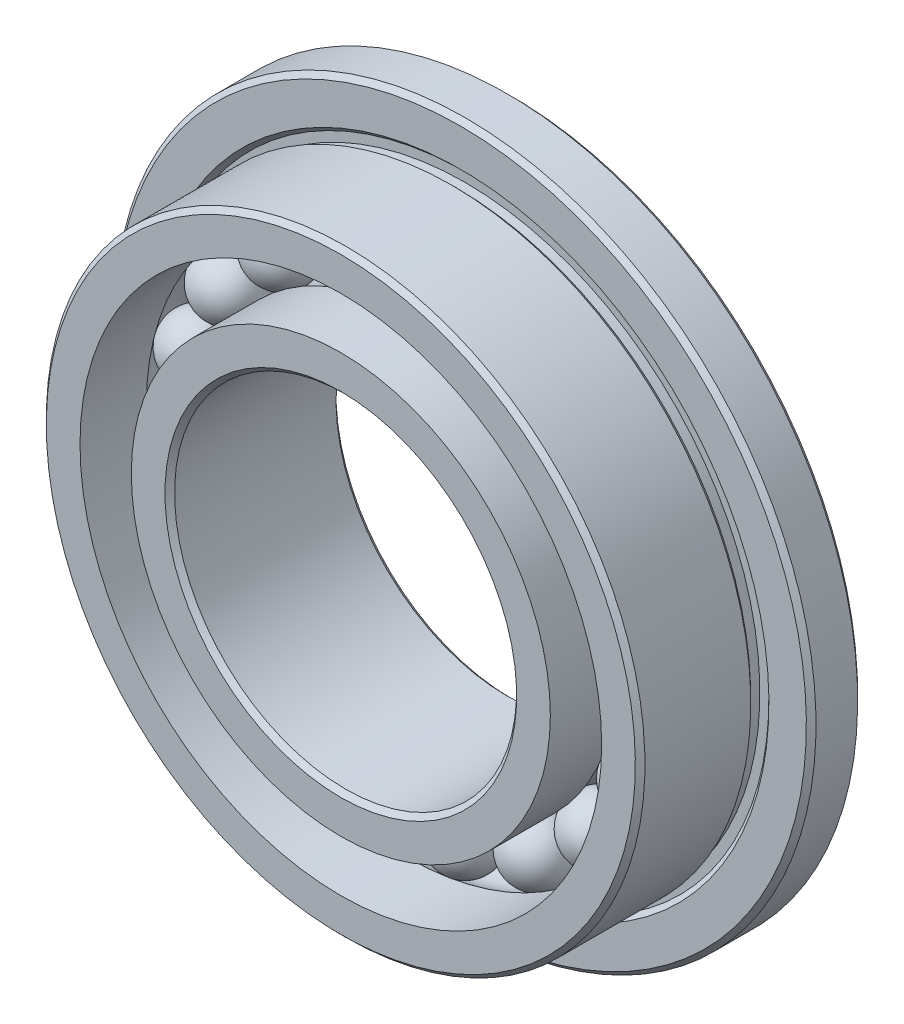
ISO-10303-21;
HEADER;
FILE_DESCRIPTION(('STEP AP214'),'2;1');
FILE_NAME('part.step','',(''),(''),'','','');
FILE_SCHEMA(('AUTOMOTIVE_DESIGN { 1 0 10303 214 1 1 1 1 }'));
ENDSEC;
DATA;
#1=APPLICATION_CONTEXT('core data for automotive mechanical design processes');
#2=APPLICATION_PROTOCOL_DEFINITION('international standard','automotive_design',2000,#1);
#3=PRODUCT_CONTEXT('',#1,'mechanical');
#4=PRODUCT('Part','Part','',(#3));
#5=PRODUCT_RELATED_PRODUCT_CATEGORY('part','',(#4));
#6=PRODUCT_DEFINITION_FORMATION('','',#4);
#7=PRODUCT_DEFINITION_CONTEXT('part definition',#1,'design');
#8=PRODUCT_DEFINITION('design','',#6,#7);
#9=PRODUCT_DEFINITION_SHAPE('','',#8);
#10=(LENGTH_UNIT() NAMED_UNIT(*) SI_UNIT(.MILLI.,.METRE.));
#11=(NAMED_UNIT(*) PLANE_ANGLE_UNIT() SI_UNIT($,.RADIAN.));
#12=(NAMED_UNIT(*) SI_UNIT($,.STERADIAN.) SOLID_ANGLE_UNIT());
#13=UNCERTAINTY_MEASURE_WITH_UNIT(LENGTH_MEASURE(1.E-05),#10,'distance_accuracy_value','');
#14=(GEOMETRIC_REPRESENTATION_CONTEXT(3) GLOBAL_UNCERTAINTY_ASSIGNED_CONTEXT((#13)) GLOBAL_UNIT_ASSIGNED_CONTEXT((#10,
#11,#12)) REPRESENTATION_CONTEXT('',''));
#15=CARTESIAN_POINT('',(0.,0.,0.));
#16=DIRECTION('',(0.,0.,1.));
#17=DIRECTION('',(1.,0.,0.));
#18=AXIS2_PLACEMENT_3D('',#15,#16,#17);
#19=CARTESIAN_POINT('',(-0.892923540312843,2.60099741467676,0.));
#20=DIRECTION('',(-0.324699469204671,0.945817241700639,0.));
#21=DIRECTION('',(0.945817241700639,0.324699469204671,0.));
#22=AXIS2_PLACEMENT_3D('',#19,#20,#21);
#23=SPHERICAL_SURFACE('',#22,0.374999999999999);
#24=CARTESIAN_POINT('',(-1.01468584126459,2.9556788803145,0.));
#25=VERTEX_POINT('',#24);
#26=VERTEX_LOOP('',#25);
#27=FACE_BOUND('',#26,.T.);
#28=ADVANCED_FACE('F50',(#27),#23,.T.);
#29=CLOSED_SHELL('',(#28));
#30=MANIFOLD_SOLID_BREP('B2',#29);
#31=CARTESIAN_POINT('',(-1.68908495989656,2.1701364008401,0.));
#32=DIRECTION('',(-0.614212712689658,0.789140509396402,0.));
#33=DIRECTION('',(0.789140509396402,0.614212712689658,0.));
#34=AXIS2_PLACEMENT_3D('',#31,#32,#33);
#35=SPHERICAL_SURFACE('',#34,0.374999999999999);
#36=CARTESIAN_POINT('',(-1.91941472715518,2.46606409186376,0.));
#37=VERTEX_POINT('',#36);
#38=VERTEX_LOOP('',#37);
#39=FACE_BOUND('',#38,.T.);
#40=ADVANCED_FACE('F71',(#39),#35,.T.);
#41=CLOSED_SHELL('',(#40));
#42=MANIFOLD_SOLID_BREP('B7',#41);
#43=CARTESIAN_POINT('',(-2.30220781522194,1.5041074348367,0.));
#44=DIRECTION('',(-0.837166478262522,0.546948158122437,0.));
#45=DIRECTION('',(0.546948158122437,0.837166478262522,0.));
#46=AXIS2_PLACEMENT_3D('',#43,#44,#45);
#47=SPHERICAL_SURFACE('',#46,0.374999999999999);
#48=CARTESIAN_POINT('',(-2.61614524457038,1.70921299413262,0.));
#49=VERTEX_POINT('',#48);
#50=VERTEX_LOOP('',#49);
#51=FACE_BOUND('',#50,.T.);
#52=ADVANCED_FACE('F92',(#51),#47,.T.);
#53=CLOSED_SHELL('',(#52));
#54=MANIFOLD_SOLID_BREP('B46',#53);
#55=CARTESIAN_POINT('',(-2.66585073133315,0.675085089637227,0.));
#56=DIRECTION('',(-0.969400265939328,0.24548548714081,0.));
#57=DIRECTION('',(0.24548548714081,0.969400265939328,0.));
#58=AXIS2_PLACEMENT_3D('',#55,#56,#57);
#59=SPHERICAL_SURFACE('',#58,0.374999999999999);
#60=CARTESIAN_POINT('',(-3.0293758310604,0.767142147315031,0.));
#61=VERTEX_POINT('',#60);
#62=VERTEX_LOOP('',#61);
#63=FACE_BOUND('',#62,.T.);
#64=ADVANCED_FACE('F113',(#63),#59,.T.);
#65=CLOSED_SHELL('',(#64));
#66=MANIFOLD_SOLID_BREP('B67',#65);
#67=CARTESIAN_POINT('',(-2.74060735576834,-0.227093200048886,0.));
#68=DIRECTION('',(-0.996584493006671,-0.0825793454723223,0.));
#69=DIRECTION('',(-0.0825793454723223,0.996584493006671,0.));
#70=AXIS2_PLACEMENT_3D('',#67,#68,#69);
#71=SPHERICAL_SURFACE('',#70,0.374999999999999);
#72=CARTESIAN_POINT('',(-3.11432654064585,-0.258060454601007,0.));
#73=VERTEX_POINT('',#72);
#74=VERTEX_LOOP('',#73);
#75=FACE_BOUND('',#74,.T.);
#76=ADVANCED_FACE('F134',(#75),#71,.T.);
#77=CLOSED_SHELL('',(#76));
#78=MANIFOLD_SOLID_BREP('B88',#77);
#79=CARTESIAN_POINT('',(-2.51837664830142,-1.10466241779564,0.));
#80=DIRECTION('',(-0.915773326655062,-0.40169542465296,0.));
#81=DIRECTION('',(-0.40169542465296,0.915773326655062,0.));
#82=AXIS2_PLACEMENT_3D('',#79,#80,#81);
#83=SPHERICAL_SURFACE('',#82,0.374999999999999);
#84=CARTESIAN_POINT('',(-2.86179164579707,-1.2552982020405,0.));
#85=VERTEX_POINT('',#84);
#86=VERTEX_LOOP('',#85);
#87=FACE_BOUND('',#86,.T.);
#88=ADVANCED_FACE('F155',(#87),#83,.T.);
#89=CLOSED_SHELL('',(#88));
#90=MANIFOLD_SOLID_BREP('B109',#89);
#91=CARTESIAN_POINT('',(-2.02324075435113,-1.86252432197077,0.));
#92=DIRECTION('',(-0.735723910673138,-0.677281571625734,0.));
#93=DIRECTION('',(-0.677281571625734,0.735723910673138,0.));
#94=AXIS2_PLACEMENT_3D('',#91,#92,#93);
#95=SPHERICAL_SURFACE('',#94,0.374999999999999);
#96=CARTESIAN_POINT('',(-2.29913722085356,-2.11650491133042,0.));
#97=VERTEX_POINT('',#96);
#98=VERTEX_LOOP('',#97);
#99=FACE_BOUND('',#98,.T.);
#100=ADVANCED_FACE('F176',(#99),#95,.T.);
#101=CLOSED_SHELL('',(#100));
#102=MANIFOLD_SOLID_BREP('B130',#101);
#103=CARTESIAN_POINT('',(-1.30885533085197,-2.41855281581783,0.));
#104=DIRECTION('',(-0.475947393037081,-0.879473751206485,0.));
#105=DIRECTION('',(-0.879473751206485,0.475947393037081,0.));
#106=AXIS2_PLACEMENT_3D('',#103,#104,#105);
#107=SPHERICAL_SURFACE('',#106,0.374999999999999);
#108=CARTESIAN_POINT('',(-1.48733560324088,-2.74835547252027,0.));
#109=VERTEX_POINT('',#108);
#110=VERTEX_LOOP('',#109);
#111=FACE_BOUND('',#110,.T.);
#112=ADVANCED_FACE('F197',(#111),#107,.T.);
#113=CLOSED_SHELL('',(#112));
#114=MANIFOLD_SOLID_BREP('B151',#113);
#115=CARTESIAN_POINT('',(-0.452635123272038,-2.71249358435748,0.));
#116=DIRECTION('',(-0.164594590280741,-0.986361303402721,0.));
#117=DIRECTION('',(-0.986361303402721,0.164594590280741,0.));
#118=AXIS2_PLACEMENT_3D('',#115,#116,#117);
#119=SPHERICAL_SURFACE('',#118,0.374999999999999);
#120=CARTESIAN_POINT('',(-0.514358094627316,-3.0823790731335,0.));
#121=VERTEX_POINT('',#120);
#122=VERTEX_LOOP('',#121);
#123=FACE_BOUND('',#122,.T.);
#124=ADVANCED_FACE('F218',(#123),#119,.T.);
#125=CLOSED_SHELL('',(#124));
#126=MANIFOLD_SOLID_BREP('B172',#125);
#127=CARTESIAN_POINT('',(0.452635123271999,-2.71249358435749,0.));
#128=DIRECTION('',(0.164594590280727,-0.986361303402724,0.));
#129=DIRECTION('',(-0.986361303402724,-0.164594590280727,0.));
#130=AXIS2_PLACEMENT_3D('',#127,#128,#129);
#131=SPHERICAL_SURFACE('',#130,0.374999999999999);
#132=CARTESIAN_POINT('',(0.514358094627272,-3.08237907313351,0.));
#133=VERTEX_POINT('',#132);
#134=VERTEX_LOOP('',#133);
#135=FACE_BOUND('',#134,.T.);
#136=ADVANCED_FACE('F239',(#135),#131,.T.);
#137=CLOSED_SHELL('',(#136));
#138=MANIFOLD_SOLID_BREP('B193',#137);
#139=CARTESIAN_POINT('',(1.30885533085194,-2.41855281581785,0.));
#140=DIRECTION('',(0.475947393037068,-0.879473751206492,0.));
#141=DIRECTION('',(-0.879473751206492,-0.475947393037068,0.));
#142=AXIS2_PLACEMENT_3D('',#139,#140,#141);
#143=SPHERICAL_SURFACE('',#142,0.374999999999999);
#144=CARTESIAN_POINT('',(1.48733560324084,-2.74835547252029,0.));
#145=VERTEX_POINT('',#144);
#146=VERTEX_LOOP('',#145);
#147=FACE_BOUND('',#146,.T.);
#148=ADVANCED_FACE('F260',(#147),#143,.T.);
#149=CLOSED_SHELL('',(#148));
#150=MANIFOLD_SOLID_BREP('B214',#149);
#151=CARTESIAN_POINT('',(2.0232407543511,-1.8625243219708,0.));
#152=DIRECTION('',(0.735723910673128,-0.677281571625745,0.));
#153=DIRECTION('',(-0.677281571625745,-0.735723910673128,0.));
#154=AXIS2_PLACEMENT_3D('',#151,#152,#153);
#155=SPHERICAL_SURFACE('',#154,0.374999999999999);
#156=CARTESIAN_POINT('',(2.29913722085353,-2.11650491133045,0.));
#157=VERTEX_POINT('',#156);
#158=VERTEX_LOOP('',#157);
#159=FACE_BOUND('',#158,.T.);
#160=ADVANCED_FACE('F281',(#159),#155,.T.);
#161=CLOSED_SHELL('',(#160));
#162=MANIFOLD_SOLID_BREP('B235',#161);
#163=CARTESIAN_POINT('',(2.5183766483014,-1.10466241779568,0.));
#164=DIRECTION('',(0.915773326655056,-0.401695424652974,0.));
#165=DIRECTION('',(-0.401695424652974,-0.915773326655056,0.));
#166=AXIS2_PLACEMENT_3D('',#163,#164,#165);
#167=SPHERICAL_SURFACE('',#166,0.374999999999999);
#168=CARTESIAN_POINT('',(2.86179164579705,-1.25529820204054,0.));
#169=VERTEX_POINT('',#168);
#170=VERTEX_LOOP('',#169);
#171=FACE_BOUND('',#170,.T.);
#172=ADVANCED_FACE('F302',(#171),#167,.T.);
#173=CLOSED_SHELL('',(#172));
#174=MANIFOLD_SOLID_BREP('B256',#173);
#175=CARTESIAN_POINT('',(2.74060735576834,-0.227093200048924,0.));
#176=DIRECTION('',(0.99658449300667,-0.0825793454723359,0.));
#177=DIRECTION('',(-0.0825793454723359,-0.99658449300667,0.));
#178=AXIS2_PLACEMENT_3D('',#175,#176,#177);
#179=SPHERICAL_SURFACE('',#178,0.374999999999999);
#180=CARTESIAN_POINT('',(3.11432654064584,-0.25806045460105,0.));
#181=VERTEX_POINT('',#180);
#182=VERTEX_LOOP('',#181);
#183=FACE_BOUND('',#182,.T.);
#184=ADVANCED_FACE('F323',(#183),#179,.T.);
#185=CLOSED_SHELL('',(#184));
#186=MANIFOLD_SOLID_BREP('B277',#185);
#187=CARTESIAN_POINT('',(2.66585073133316,0.67508508963719,0.));
#188=DIRECTION('',(0.969400265939331,0.245485487140796,0.));
#189=DIRECTION('',(0.245485487140796,-0.969400265939331,0.));
#190=AXIS2_PLACEMENT_3D('',#187,#188,#189);
#191=SPHERICAL_SURFACE('',#190,0.374999999999999);
#192=CARTESIAN_POINT('',(3.02937583106041,0.767142147314988,0.));
#193=VERTEX_POINT('',#192);
#194=VERTEX_LOOP('',#193);
#195=FACE_BOUND('',#194,.T.);
#196=ADVANCED_FACE('F344',(#195),#191,.T.);
#197=CLOSED_SHELL('',(#196));
#198=MANIFOLD_SOLID_BREP('B298',#197);
#199=CARTESIAN_POINT('',(2.30220781522196,1.50410743483667,0.));
#200=DIRECTION('',(0.83716647826253,0.546948158122425,0.));
#201=DIRECTION('',(0.546948158122425,-0.83716647826253,0.));
#202=AXIS2_PLACEMENT_3D('',#199,#200,#201);
#203=SPHERICAL_SURFACE('',#202,0.374999999999999);
#204=CARTESIAN_POINT('',(2.61614524457041,1.70921299413258,0.));
#205=VERTEX_POINT('',#204);
#206=VERTEX_LOOP('',#205);
#207=FACE_BOUND('',#206,.T.);
#208=ADVANCED_FACE('F365',(#207),#203,.T.);
#209=CLOSED_SHELL('',(#208));
#210=MANIFOLD_SOLID_BREP('B319',#209);
#211=CARTESIAN_POINT('',(1.68908495989659,2.17013640084008,0.));
#212=DIRECTION('',(0.614212712689669,0.789140509396393,0.));
#213=DIRECTION('',(0.789140509396393,-0.614212712689669,0.));
#214=AXIS2_PLACEMENT_3D('',#211,#212,#213);
#215=SPHERICAL_SURFACE('',#214,0.374999999999999);
#216=CARTESIAN_POINT('',(1.91941472715522,2.46606409186373,0.));
#217=VERTEX_POINT('',#216);
#218=VERTEX_LOOP('',#217);
#219=FACE_BOUND('',#218,.T.);
#220=ADVANCED_FACE('F386',(#219),#215,.T.);
#221=CLOSED_SHELL('',(#220));
#222=MANIFOLD_SOLID_BREP('B340',#221);
#223=CARTESIAN_POINT('',(0.892923540312882,2.60099741467674,0.));
#224=DIRECTION('',(0.324699469204684,0.945817241700635,0.));
#225=DIRECTION('',(0.945817241700635,-0.324699469204684,0.));
#226=AXIS2_PLACEMENT_3D('',#223,#224,#225);
#227=SPHERICAL_SURFACE('',#226,0.374999999999999);
#228=CARTESIAN_POINT('',(1.01468584126464,2.95567888031448,0.));
#229=VERTEX_POINT('',#228);
#230=VERTEX_LOOP('',#229);
#231=FACE_BOUND('',#230,.T.);
#232=ADVANCED_FACE('F407',(#231),#227,.T.);
#233=CLOSED_SHELL('',(#232));
#234=MANIFOLD_SOLID_BREP('B361',#233);
#235=CARTESIAN_POINT('',(0.,2.75,0.));
#236=DIRECTION('',(0.,1.,0.));
#237=DIRECTION('',(1.,0.,0.));
#238=AXIS2_PLACEMENT_3D('',#235,#236,#237);
#239=SPHERICAL_SURFACE('',#238,0.374999999999999);
#240=CARTESIAN_POINT('',(0.,3.125,0.));
#241=VERTEX_POINT('',#240);
#242=VERTEX_LOOP('',#241);
#243=FACE_BOUND('',#242,.T.);
#244=ADVANCED_FACE('F431',(#243),#239,.T.);
#245=CLOSED_SHELL('',(#244));
#246=MANIFOLD_SOLID_BREP('B382',#245);
#247=CARTESIAN_POINT('',(0.,0.,0.));
#248=DIRECTION('',(0.,0.,1.));
#249=DIRECTION('',(0.,-1.,0.));
#250=AXIS2_PLACEMENT_3D('',#247,#248,#249);
#251=CYLINDRICAL_SURFACE('',#250,2.45);
#252=CARTESIAN_POINT('',(0.,0.,-0.225));
#253=DIRECTION('',(0.,0.,1.));
#254=DIRECTION('',(0.,-1.,0.));
#255=AXIS2_PLACEMENT_3D('',#252,#253,#254);
#256=CIRCLE('',#255,2.45);
#257=CARTESIAN_POINT('',(0.,-2.45,-0.225));
#258=VERTEX_POINT('',#257);
#259=EDGE_CURVE('E479',#258,#258,#256,.T.);
#260=ORIENTED_EDGE('',*,*,#259,.F.);
#261=EDGE_LOOP('',(#260));
#262=FACE_BOUND('',#261,.T.);
#263=CARTESIAN_POINT('',(0.,0.,-1.));
#264=DIRECTION('',(0.,0.,1.));
#265=DIRECTION('',(0.,-1.,0.));
#266=AXIS2_PLACEMENT_3D('',#263,#264,#265);
#267=CIRCLE('',#266,2.45);
#268=CARTESIAN_POINT('',(0.,-2.45,-1.));
#269=VERTEX_POINT('',#268);
#270=EDGE_CURVE('E491',#269,#269,#267,.T.);
#271=ORIENTED_EDGE('',*,*,#270,.T.);
#272=EDGE_LOOP('',(#271));
#273=FACE_BOUND('',#272,.T.);
#274=ADVANCED_FACE('F453',(#262,#273),#251,.T.);
#275=CARTESIAN_POINT('',(0.,0.,0.));
#276=DIRECTION('',(0.,0.,1.));
#277=DIRECTION('',(0.,-1.,0.));
#278=AXIS2_PLACEMENT_3D('',#275,#276,#277);
#279=TOROIDAL_SURFACE('',#278,2.75,0.375);
#280=CARTESIAN_POINT('',(0.,0.,0.225));
#281=DIRECTION('',(0.,0.,1.));
#282=DIRECTION('',(0.,-1.,0.));
#283=AXIS2_PLACEMENT_3D('',#280,#281,#282);
#284=CIRCLE('',#283,2.45);
#285=CARTESIAN_POINT('',(0.,-2.45,0.225));
#286=VERTEX_POINT('',#285);
#287=EDGE_CURVE('E483',#286,#286,#284,.T.);
#288=ORIENTED_EDGE('',*,*,#287,.F.);
#289=EDGE_LOOP('',(#288));
#290=FACE_BOUND('',#289,.T.);
#291=ORIENTED_EDGE('',*,*,#259,.T.);
#292=EDGE_LOOP('',(#291));
#293=FACE_BOUND('',#292,.T.);
#294=ADVANCED_FACE('F512',(#290,#293),#279,.F.);
#295=CARTESIAN_POINT('',(0.,0.,0.));
#296=DIRECTION('',(0.,0.,1.));
#297=DIRECTION('',(0.,-1.,0.));
#298=AXIS2_PLACEMENT_3D('',#295,#296,#297);
#299=CYLINDRICAL_SURFACE('',#298,2.45);
#300=CARTESIAN_POINT('',(0.,0.,1.));
#301=DIRECTION('',(0.,0.,1.));
#302=DIRECTION('',(0.,-1.,0.));
#303=AXIS2_PLACEMENT_3D('',#300,#301,#302);
#304=CIRCLE('',#303,2.45);
#305=CARTESIAN_POINT('',(0.,-2.45,1.));
#306=VERTEX_POINT('',#305);
#307=EDGE_CURVE('E487',#306,#306,#304,.T.);
#308=ORIENTED_EDGE('',*,*,#307,.F.);
#309=EDGE_LOOP('',(#308));
#310=FACE_BOUND('',#309,.T.);
#311=ORIENTED_EDGE('',*,*,#287,.T.);
#312=EDGE_LOOP('',(#311));
#313=FACE_BOUND('',#312,.T.);
#314=ADVANCED_FACE('F518',(#310,#313),#299,.T.);
#315=CARTESIAN_POINT('',(0.,2.,1.));
#316=DIRECTION('',(0.,0.,-1.));
#317=DIRECTION('',(0.,1.,0.));
#318=AXIS2_PLACEMENT_3D('',#315,#316,#317);
#319=PLANE('',#318);
#320=CARTESIAN_POINT('',(0.,0.,1.));
#321=DIRECTION('',(0.,0.,-1.));
#322=DIRECTION('',(0.,1.,0.));
#323=AXIS2_PLACEMENT_3D('',#320,#321,#322);
#324=CIRCLE('',#323,2.05625);
#325=CARTESIAN_POINT('',(0.,2.05625,1.));
#326=VERTEX_POINT('',#325);
#327=EDGE_CURVE('E430',#326,#326,#324,.T.);
#328=ORIENTED_EDGE('',*,*,#327,.T.);
#329=EDGE_LOOP('',(#328));
#330=FACE_BOUND('',#329,.T.);
#331=ORIENTED_EDGE('',*,*,#307,.T.);
#332=EDGE_LOOP('',(#331));
#333=FACE_BOUND('',#332,.T.);
#334=ADVANCED_FACE('F509',(#330,#333),#319,.F.);
#335=CARTESIAN_POINT('',(0.,0.,0.));
#336=DIRECTION('',(0.,0.,1.));
#337=DIRECTION('',(0.,-1.,0.));
#338=AXIS2_PLACEMENT_3D('',#335,#336,#337);
#339=CYLINDRICAL_SURFACE('',#338,2.);
#340=CARTESIAN_POINT('',(0.,0.,-0.943750000000001));
#341=DIRECTION('',(0.,0.,1.));
#342=DIRECTION('',(0.,-1.,0.));
#343=AXIS2_PLACEMENT_3D('',#340,#341,#342);
#344=CIRCLE('',#343,2.);
#345=CARTESIAN_POINT('',(0.,-2.,-0.943750000000001));
#346=VERTEX_POINT('',#345);
#347=EDGE_CURVE('E461',#346,#346,#344,.F.);
#348=ORIENTED_EDGE('',*,*,#347,.T.);
#349=EDGE_LOOP('',(#348));
#350=FACE_BOUND('',#349,.T.);
#351=CARTESIAN_POINT('',(0.,0.,0.94375));
#352=DIRECTION('',(0.,0.,-1.));
#353=DIRECTION('',(0.,1.,0.));
#354=AXIS2_PLACEMENT_3D('',#351,#352,#353);
#355=CIRCLE('',#354,2.);
#356=CARTESIAN_POINT('',(0.,2.,0.94375));
#357=VERTEX_POINT('',#356);
#358=EDGE_CURVE('E467',#357,#357,#355,.F.);
#359=ORIENTED_EDGE('',*,*,#358,.T.);
#360=EDGE_LOOP('',(#359));
#361=FACE_BOUND('',#360,.T.);
#362=ADVANCED_FACE('F501',(#350,#361),#339,.F.);
#363=CARTESIAN_POINT('',(0.,2.45,-1.));
#364=DIRECTION('',(0.,0.,1.));
#365=DIRECTION('',(0.,-1.,0.));
#366=AXIS2_PLACEMENT_3D('',#363,#364,#365);
#367=PLANE('',#366);
#368=CARTESIAN_POINT('',(0.,0.,-1.));
#369=DIRECTION('',(0.,0.,1.));
#370=DIRECTION('',(0.,-1.,0.));
#371=AXIS2_PLACEMENT_3D('',#368,#369,#370);
#372=CIRCLE('',#371,2.05625);
#373=CARTESIAN_POINT('',(0.,-2.05625,-1.));
#374=VERTEX_POINT('',#373);
#375=EDGE_CURVE('E473',#374,#374,#372,.T.);
#376=ORIENTED_EDGE('',*,*,#375,.T.);
#377=EDGE_LOOP('',(#376));
#378=FACE_BOUND('',#377,.T.);
#379=ORIENTED_EDGE('',*,*,#270,.F.);
#380=EDGE_LOOP('',(#379));
#381=FACE_BOUND('',#380,.T.);
#382=ADVANCED_FACE('F498',(#378,#381),#367,.F.);
#383=CARTESIAN_POINT('',(0.,0.,-1.));
#384=DIRECTION('',(0.,0.,-1.));
#385=DIRECTION('',(0.,1.,0.));
#386=AXIS2_PLACEMENT_3D('',#383,#384,#385);
#387=CONICAL_SURFACE('',#386,2.05625,0.785398163397448);
#388=ORIENTED_EDGE('',*,*,#347,.F.);
#389=EDGE_LOOP('',(#388));
#390=FACE_BOUND('',#389,.T.);
#391=ORIENTED_EDGE('',*,*,#375,.F.);
#392=EDGE_LOOP('',(#391));
#393=FACE_BOUND('',#392,.T.);
#394=ADVANCED_FACE('F500',(#390,#393),#387,.F.);
#395=CARTESIAN_POINT('',(0.,0.,0.94375));
#396=DIRECTION('',(0.,0.,1.));
#397=DIRECTION('',(0.,-1.,0.));
#398=AXIS2_PLACEMENT_3D('',#395,#396,#397);
#399=CONICAL_SURFACE('',#398,2.,0.785398163397446);
#400=ORIENTED_EDGE('',*,*,#327,.F.);
#401=EDGE_LOOP('',(#400));
#402=FACE_BOUND('',#401,.T.);
#403=ORIENTED_EDGE('',*,*,#358,.F.);
#404=EDGE_LOOP('',(#403));
#405=FACE_BOUND('',#404,.T.);
#406=ADVANCED_FACE('F455',(#402,#405),#399,.F.);
#407=CLOSED_SHELL('',(#274,#294,#314,#334,#362,#382,#394,#406));
#408=MANIFOLD_SOLID_BREP('B403',#407);
#409=CARTESIAN_POINT('',(0.,3.05,-1.));
#410=DIRECTION('',(0.,0.,1.));
#411=DIRECTION('',(0.,-1.,0.));
#412=AXIS2_PLACEMENT_3D('',#409,#410,#411);
#413=PLANE('',#412);
#414=CARTESIAN_POINT('',(0.,0.,-1.));
#415=DIRECTION('',(0.,0.,1.));
#416=DIRECTION('',(0.,-1.,0.));
#417=AXIS2_PLACEMENT_3D('',#414,#415,#416);
#418=CIRCLE('',#417,4.04375);
#419=CARTESIAN_POINT('',(0.,-4.04375,-1.));
#420=VERTEX_POINT('',#419);
#421=EDGE_CURVE('E612',#420,#420,#418,.F.);
#422=ORIENTED_EDGE('',*,*,#421,.T.);
#423=EDGE_LOOP('',(#422));
#424=FACE_BOUND('',#423,.T.);
#425=CARTESIAN_POINT('',(0.,0.,-1.));
#426=DIRECTION('',(0.,0.,1.));
#427=DIRECTION('',(0.,-1.,0.));
#428=AXIS2_PLACEMENT_3D('',#425,#426,#427);
#429=CIRCLE('',#428,3.05);
#430=CARTESIAN_POINT('',(0.,-3.05,-1.));
#431=VERTEX_POINT('',#430);
#432=EDGE_CURVE('E626',#431,#431,#429,.T.);
#433=ORIENTED_EDGE('',*,*,#432,.T.);
#434=EDGE_LOOP('',(#433));
#435=FACE_BOUND('',#434,.T.);
#436=ADVANCED_FACE('F592',(#424,#435),#413,.F.);
#437=CARTESIAN_POINT('',(0.,0.,0.));
#438=DIRECTION('',(0.,0.,1.));
#439=DIRECTION('',(0.,-1.,0.));
#440=AXIS2_PLACEMENT_3D('',#437,#438,#439);
#441=CYLINDRICAL_SURFACE('',#440,3.05);
#442=ORIENTED_EDGE('',*,*,#432,.F.);
#443=EDGE_LOOP('',(#442));
#444=FACE_BOUND('',#443,.T.);
#445=CARTESIAN_POINT('',(0.,0.,-0.225));
#446=DIRECTION('',(0.,0.,1.));
#447=DIRECTION('',(0.,-1.,0.));
#448=AXIS2_PLACEMENT_3D('',#445,#446,#447);
#449=CIRCLE('',#448,3.05);
#450=CARTESIAN_POINT('',(0.,-3.05,-0.225));
#451=VERTEX_POINT('',#450);
#452=EDGE_CURVE('E630',#451,#451,#449,.T.);
#453=ORIENTED_EDGE('',*,*,#452,.T.);
#454=EDGE_LOOP('',(#453));
#455=FACE_BOUND('',#454,.T.);
#456=ADVANCED_FACE('F682',(#444,#455),#441,.F.);
#457=CARTESIAN_POINT('',(0.,0.,0.));
#458=DIRECTION('',(0.,0.,1.));
#459=DIRECTION('',(0.,-1.,0.));
#460=AXIS2_PLACEMENT_3D('',#457,#458,#459);
#461=TOROIDAL_SURFACE('',#460,2.75,0.375);
#462=ORIENTED_EDGE('',*,*,#452,.F.);
#463=EDGE_LOOP('',(#462));
#464=FACE_BOUND('',#463,.T.);
#465=CARTESIAN_POINT('',(0.,0.,0.225));
#466=DIRECTION('',(0.,0.,1.));
#467=DIRECTION('',(0.,-1.,0.));
#468=AXIS2_PLACEMENT_3D('',#465,#466,#467);
#469=CIRCLE('',#468,3.05);
#470=CARTESIAN_POINT('',(0.,-3.05,0.225));
#471=VERTEX_POINT('',#470);
#472=EDGE_CURVE('E634',#471,#471,#469,.T.);
#473=ORIENTED_EDGE('',*,*,#472,.T.);
#474=EDGE_LOOP('',(#473));
#475=FACE_BOUND('',#474,.T.);
#476=ADVANCED_FACE('F688',(#464,#475),#461,.F.);
#477=CARTESIAN_POINT('',(0.,0.,0.));
#478=DIRECTION('',(0.,0.,1.));
#479=DIRECTION('',(0.,-1.,0.));
#480=AXIS2_PLACEMENT_3D('',#477,#478,#479);
#481=CYLINDRICAL_SURFACE('',#480,3.05);
#482=ORIENTED_EDGE('',*,*,#472,.F.);
#483=EDGE_LOOP('',(#482));
#484=FACE_BOUND('',#483,.T.);
#485=CARTESIAN_POINT('',(0.,0.,1.));
#486=DIRECTION('',(0.,0.,1.));
#487=DIRECTION('',(0.,-1.,0.));
#488=AXIS2_PLACEMENT_3D('',#485,#486,#487);
#489=CIRCLE('',#488,3.05);
#490=CARTESIAN_POINT('',(0.,-3.05,1.));
#491=VERTEX_POINT('',#490);
#492=EDGE_CURVE('E638',#491,#491,#489,.T.);
#493=ORIENTED_EDGE('',*,*,#492,.T.);
#494=EDGE_LOOP('',(#493));
#495=FACE_BOUND('',#494,.T.);
#496=ADVANCED_FACE('F752',(#484,#495),#481,.F.);
#497=CARTESIAN_POINT('',(0.,3.5,1.));
#498=DIRECTION('',(0.,0.,-1.));
#499=DIRECTION('',(0.,1.,0.));
#500=AXIS2_PLACEMENT_3D('',#497,#498,#499);
#501=PLANE('',#500);
#502=CARTESIAN_POINT('',(0.,0.,1.));
#503=DIRECTION('',(0.,0.,-1.));
#504=DIRECTION('',(0.,1.,0.));
#505=AXIS2_PLACEMENT_3D('',#502,#503,#504);
#506=CIRCLE('',#505,3.44375);
#507=CARTESIAN_POINT('',(0.,3.44375,1.));
#508=VERTEX_POINT('',#507);
#509=EDGE_CURVE('E600',#508,#508,#506,.F.);
#510=ORIENTED_EDGE('',*,*,#509,.T.);
#511=EDGE_LOOP('',(#510));
#512=FACE_BOUND('',#511,.T.);
#513=ORIENTED_EDGE('',*,*,#492,.F.);
#514=EDGE_LOOP('',(#513));
#515=FACE_BOUND('',#514,.T.);
#516=ADVANCED_FACE('F742',(#512,#515),#501,.F.);
#517=CARTESIAN_POINT('',(0.,0.,0.));
#518=DIRECTION('',(0.,0.,1.));
#519=DIRECTION('',(0.,-1.,0.));
#520=AXIS2_PLACEMENT_3D('',#517,#518,#519);
#521=CYLINDRICAL_SURFACE('',#520,3.5);
#522=CARTESIAN_POINT('',(0.,0.,0.94375));
#523=DIRECTION('',(0.,0.,-1.));
#524=DIRECTION('',(0.,1.,0.));
#525=AXIS2_PLACEMENT_3D('',#522,#523,#524);
#526=CIRCLE('',#525,3.5);
#527=CARTESIAN_POINT('',(0.,3.5,0.94375));
#528=VERTEX_POINT('',#527);
#529=EDGE_CURVE('E452',#528,#528,#526,.T.);
#530=ORIENTED_EDGE('',*,*,#529,.T.);
#531=EDGE_LOOP('',(#530));
#532=FACE_BOUND('',#531,.T.);
#533=CARTESIAN_POINT('',(0.,0.,-0.293933982822018));
#534=DIRECTION('',(0.,0.,1.));
#535=DIRECTION('',(0.,-1.,0.));
#536=AXIS2_PLACEMENT_3D('',#533,#534,#535);
#537=CIRCLE('',#536,3.5);
#538=CARTESIAN_POINT('',(0.,-3.5,-0.293933982822018));
#539=VERTEX_POINT('',#538);
#540=EDGE_CURVE('E642',#539,#539,#537,.T.);
#541=ORIENTED_EDGE('',*,*,#540,.T.);
#542=EDGE_LOOP('',(#541));
#543=FACE_BOUND('',#542,.T.);
#544=ADVANCED_FACE('F736',(#532,#543),#521,.T.);
#545=CARTESIAN_POINT('',(0.,0.,-0.34696699141101));
#546=DIRECTION('',(0.,0.,1.));
#547=DIRECTION('',(0.,-1.,0.));
#548=AXIS2_PLACEMENT_3D('',#545,#546,#547);
#549=CONICAL_SURFACE('',#548,3.44696699141101,0.785398163397443);
#550=ORIENTED_EDGE('',*,*,#540,.F.);
#551=EDGE_LOOP('',(#550));
#552=FACE_BOUND('',#551,.T.);
#553=CARTESIAN_POINT('',(0.,0.,-0.34696699141101));
#554=DIRECTION('',(0.,0.,1.));
#555=DIRECTION('',(0.,-1.,0.));
#556=AXIS2_PLACEMENT_3D('',#553,#554,#555);
#557=CIRCLE('',#556,3.44696699141101);
#558=CARTESIAN_POINT('',(0.,-3.44696699141101,-0.34696699141101));
#559=VERTEX_POINT('',#558);
#560=EDGE_CURVE('E646',#559,#559,#557,.T.);
#561=ORIENTED_EDGE('',*,*,#560,.T.);
#562=EDGE_LOOP('',(#561));
#563=FACE_BOUND('',#562,.T.);
#564=ADVANCED_FACE('F741',(#552,#563),#549,.T.);
#565=CARTESIAN_POINT('',(0.,0.,0.));
#566=DIRECTION('',(0.,0.,1.));
#567=DIRECTION('',(0.,-1.,0.));
#568=AXIS2_PLACEMENT_3D('',#565,#566,#567);
#569=CYLINDRICAL_SURFACE('',#568,3.44696699141101);
#570=ORIENTED_EDGE('',*,*,#560,.F.);
#571=EDGE_LOOP('',(#570));
#572=FACE_BOUND('',#571,.T.);
#573=CARTESIAN_POINT('',(0.,0.,-0.453033008588992));
#574=DIRECTION('',(0.,0.,1.));
#575=DIRECTION('',(0.,-1.,0.));
#576=AXIS2_PLACEMENT_3D('',#573,#574,#575);
#577=CIRCLE('',#576,3.44696699141101);
#578=CARTESIAN_POINT('',(0.,-3.44696699141101,-0.453033008588993));
#579=VERTEX_POINT('',#578);
#580=EDGE_CURVE('E650',#579,#579,#577,.T.);
#581=ORIENTED_EDGE('',*,*,#580,.T.);
#582=EDGE_LOOP('',(#581));
#583=FACE_BOUND('',#582,.T.);
#584=ADVANCED_FACE('F774',(#572,#583),#569,.T.);
#585=CARTESIAN_POINT('',(0.,3.55303300858899,-0.453033008588992));
#586=DIRECTION('',(0.,0.,-1.));
#587=DIRECTION('',(0.,1.,0.));
#588=AXIS2_PLACEMENT_3D('',#585,#586,#587);
#589=PLANE('',#588);
#590=ORIENTED_EDGE('',*,*,#580,.F.);
#591=EDGE_LOOP('',(#590));
#592=FACE_BOUND('',#591,.T.);
#593=CARTESIAN_POINT('',(0.,0.,-0.453033008588992));
#594=DIRECTION('',(0.,0.,1.));
#595=DIRECTION('',(0.,-1.,0.));
#596=AXIS2_PLACEMENT_3D('',#593,#594,#595);
#597=CIRCLE('',#596,3.55303300858899);
#598=CARTESIAN_POINT('',(0.,-3.55303300858899,-0.453033008588992));
#599=VERTEX_POINT('',#598);
#600=EDGE_CURVE('E654',#599,#599,#597,.T.);
#601=ORIENTED_EDGE('',*,*,#600,.T.);
#602=EDGE_LOOP('',(#601));
#603=FACE_BOUND('',#602,.T.);
#604=ADVANCED_FACE('F678',(#592,#603),#589,.F.);
#605=CARTESIAN_POINT('',(0.,0.,-0.400000000000001));
#606=DIRECTION('',(0.,0.,1.));
#607=DIRECTION('',(0.,-1.,0.));
#608=AXIS2_PLACEMENT_3D('',#605,#606,#607);
#609=CONICAL_SURFACE('',#608,3.60606601717798,0.78539816339744);
#610=ORIENTED_EDGE('',*,*,#600,.F.);
#611=EDGE_LOOP('',(#610));
#612=FACE_BOUND('',#611,.T.);
#613=CARTESIAN_POINT('',(0.,0.,-0.400000000000001));
#614=DIRECTION('',(0.,0.,1.));
#615=DIRECTION('',(0.,-1.,0.));
#616=AXIS2_PLACEMENT_3D('',#613,#614,#615);
#617=CIRCLE('',#616,3.60606601717798);
#618=CARTESIAN_POINT('',(0.,-3.60606601717798,-0.400000000000001));
#619=VERTEX_POINT('',#618);
#620=EDGE_CURVE('E658',#619,#619,#617,.T.);
#621=ORIENTED_EDGE('',*,*,#620,.T.);
#622=EDGE_LOOP('',(#621));
#623=FACE_BOUND('',#622,.T.);
#624=ADVANCED_FACE('F664',(#612,#623),#609,.F.);
#625=CARTESIAN_POINT('',(0.,4.1,-0.400000000000001));
#626=DIRECTION('',(0.,0.,-1.));
#627=DIRECTION('',(0.,1.,0.));
#628=AXIS2_PLACEMENT_3D('',#625,#626,#627);
#629=PLANE('',#628);
#630=CARTESIAN_POINT('',(0.,0.,-0.400000000000001));
#631=DIRECTION('',(0.,0.,-1.));
#632=DIRECTION('',(0.,1.,0.));
#633=AXIS2_PLACEMENT_3D('',#630,#631,#632);
#634=CIRCLE('',#633,4.04375);
#635=CARTESIAN_POINT('',(0.,4.04375,-0.400000000000001));
#636=VERTEX_POINT('',#635);
#637=EDGE_CURVE('E606',#636,#636,#634,.F.);
#638=ORIENTED_EDGE('',*,*,#637,.T.);
#639=EDGE_LOOP('',(#638));
#640=FACE_BOUND('',#639,.T.);
#641=ORIENTED_EDGE('',*,*,#620,.F.);
#642=EDGE_LOOP('',(#641));
#643=FACE_BOUND('',#642,.T.);
#644=ADVANCED_FACE('F666',(#640,#643),#629,.F.);
#645=CARTESIAN_POINT('',(0.,0.,0.));
#646=DIRECTION('',(0.,0.,1.));
#647=DIRECTION('',(0.,-1.,0.));
#648=AXIS2_PLACEMENT_3D('',#645,#646,#647);
#649=CYLINDRICAL_SURFACE('',#648,4.1);
#650=CARTESIAN_POINT('',(0.,0.,-0.943750000000001));
#651=DIRECTION('',(0.,0.,1.));
#652=DIRECTION('',(0.,-1.,0.));
#653=AXIS2_PLACEMENT_3D('',#650,#651,#652);
#654=CIRCLE('',#653,4.1);
#655=CARTESIAN_POINT('',(0.,-4.1,-0.943750000000001));
#656=VERTEX_POINT('',#655);
#657=EDGE_CURVE('E618',#656,#656,#654,.T.);
#658=ORIENTED_EDGE('',*,*,#657,.T.);
#659=EDGE_LOOP('',(#658));
#660=FACE_BOUND('',#659,.T.);
#661=CARTESIAN_POINT('',(0.,0.,-0.456250000000001));
#662=DIRECTION('',(0.,0.,-1.));
#663=DIRECTION('',(0.,1.,0.));
#664=AXIS2_PLACEMENT_3D('',#661,#662,#663);
#665=CIRCLE('',#664,4.1);
#666=CARTESIAN_POINT('',(0.,4.1,-0.456250000000001));
#667=VERTEX_POINT('',#666);
#668=EDGE_CURVE('E622',#667,#667,#665,.T.);
#669=ORIENTED_EDGE('',*,*,#668,.T.);
#670=EDGE_LOOP('',(#669));
#671=FACE_BOUND('',#670,.T.);
#672=ADVANCED_FACE('F668',(#660,#671),#649,.T.);
#673=CARTESIAN_POINT('',(0.,0.,-0.943750000000001));
#674=DIRECTION('',(0.,0.,1.));
#675=DIRECTION('',(0.,-1.,0.));
#676=AXIS2_PLACEMENT_3D('',#673,#674,#675);
#677=CONICAL_SURFACE('',#676,4.1,0.785398163397448);
#678=ORIENTED_EDGE('',*,*,#421,.F.);
#679=EDGE_LOOP('',(#678));
#680=FACE_BOUND('',#679,.T.);
#681=ORIENTED_EDGE('',*,*,#657,.F.);
#682=EDGE_LOOP('',(#681));
#683=FACE_BOUND('',#682,.T.);
#684=ADVANCED_FACE('F675',(#680,#683),#677,.T.);
#685=CARTESIAN_POINT('',(0.,0.,-0.400000000000001));
#686=DIRECTION('',(0.,0.,-1.));
#687=DIRECTION('',(0.,1.,0.));
#688=AXIS2_PLACEMENT_3D('',#685,#686,#687);
#689=CONICAL_SURFACE('',#688,4.04375,0.785398163397447);
#690=CARTESIAN_POINT('',(0.,4.1,-0.456250000000001));
#691=CARTESIAN_POINT('',(0.,4.0994140625,-0.455664062500001));
#692=CARTESIAN_POINT('',(0.,4.098828125,-0.455078125000001));
#693=CARTESIAN_POINT('',(0.,4.09765625,-0.453906250000001));
#694=CARTESIAN_POINT('',(0.,4.0970703125,-0.453320312500001));
#695=CARTESIAN_POINT('',(0.,4.0958984375,-0.452148437500001));
#696=CARTESIAN_POINT('',(0.,4.0953125,-0.451562500000001));
#697=CARTESIAN_POINT('',(0.,4.094140625,-0.450390625000001));
#698=CARTESIAN_POINT('',(0.,4.0935546875,-0.449804687500001));
#699=CARTESIAN_POINT('',(0.,4.0923828125,-0.448632812500001));
#700=CARTESIAN_POINT('',(0.,4.091796875,-0.448046875000001));
#701=CARTESIAN_POINT('',(0.,4.090625,-0.446875000000001));
#702=CARTESIAN_POINT('',(0.,4.0900390625,-0.446289062500001));
#703=CARTESIAN_POINT('',(0.,4.0888671875,-0.445117187500001));
#704=CARTESIAN_POINT('',(0.,4.08828125,-0.444531250000001));
#705=CARTESIAN_POINT('',(0.,4.087109375,-0.443359375000001));
#706=CARTESIAN_POINT('',(0.,4.0865234375,-0.442773437500001));
#707=CARTESIAN_POINT('',(0.,4.0853515625,-0.441601562500001));
#708=CARTESIAN_POINT('',(0.,4.084765625,-0.441015625000001));
#709=CARTESIAN_POINT('',(0.,4.08359375,-0.439843750000001));
#710=CARTESIAN_POINT('',(0.,4.0830078125,-0.439257812500001));
#711=CARTESIAN_POINT('',(0.,4.0818359375,-0.438085937500001));
#712=CARTESIAN_POINT('',(0.,4.08125,-0.437500000000001));
#713=CARTESIAN_POINT('',(0.,4.080078125,-0.436328125000001));
#714=CARTESIAN_POINT('',(0.,4.0794921875,-0.435742187500001));
#715=CARTESIAN_POINT('',(0.,4.0783203125,-0.434570312500001));
#716=CARTESIAN_POINT('',(0.,4.077734375,-0.433984375000001));
#717=CARTESIAN_POINT('',(0.,4.0765625,-0.432812500000001));
#718=CARTESIAN_POINT('',(0.,4.0759765625,-0.432226562500001));
#719=CARTESIAN_POINT('',(0.,4.0748046875,-0.431054687500001));
#720=CARTESIAN_POINT('',(0.,4.07421875,-0.430468750000001));
#721=CARTESIAN_POINT('',(0.,4.073046875,-0.429296875000001));
#722=CARTESIAN_POINT('',(0.,4.0724609375,-0.428710937500001));
#723=CARTESIAN_POINT('',(0.,4.0712890625,-0.427539062500001));
#724=CARTESIAN_POINT('',(0.,4.070703125,-0.426953125000001));
#725=CARTESIAN_POINT('',(0.,4.06953125,-0.425781250000001));
#726=CARTESIAN_POINT('',(0.,4.0689453125,-0.425195312500001));
#727=CARTESIAN_POINT('',(0.,4.0677734375,-0.424023437500001));
#728=CARTESIAN_POINT('',(0.,4.0671875,-0.423437500000001));
#729=CARTESIAN_POINT('',(0.,4.066015625,-0.422265625000001));
#730=CARTESIAN_POINT('',(0.,4.0654296875,-0.421679687500001));
#731=CARTESIAN_POINT('',(0.,4.0642578125,-0.420507812500001));
#732=CARTESIAN_POINT('',(0.,4.063671875,-0.419921875000001));
#733=CARTESIAN_POINT('',(0.,4.0625,-0.418750000000001));
#734=CARTESIAN_POINT('',(0.,4.0619140625,-0.418164062500001));
#735=CARTESIAN_POINT('',(0.,4.0607421875,-0.416992187500001));
#736=CARTESIAN_POINT('',(0.,4.06015625,-0.416406250000001));
#737=CARTESIAN_POINT('',(0.,4.058984375,-0.415234375000001));
#738=CARTESIAN_POINT('',(0.,4.0583984375,-0.414648437500001));
#739=CARTESIAN_POINT('',(0.,4.0572265625,-0.413476562500001));
#740=CARTESIAN_POINT('',(0.,4.056640625,-0.412890625000001));
#741=CARTESIAN_POINT('',(0.,4.05546875,-0.411718750000001));
#742=CARTESIAN_POINT('',(0.,4.0548828125,-0.411132812500001));
#743=CARTESIAN_POINT('',(0.,4.0537109375,-0.409960937500001));
#744=CARTESIAN_POINT('',(0.,4.053125,-0.409375000000001));
#745=CARTESIAN_POINT('',(0.,4.051953125,-0.408203125000001));
#746=CARTESIAN_POINT('',(0.,4.0513671875,-0.407617187500001));
#747=CARTESIAN_POINT('',(0.,4.0501953125,-0.406445312500001));
#748=CARTESIAN_POINT('',(0.,4.049609375,-0.405859375000001));
#749=CARTESIAN_POINT('',(0.,4.0484375,-0.404687500000001));
#750=CARTESIAN_POINT('',(0.,4.0478515625,-0.404101562500001));
#751=CARTESIAN_POINT('',(0.,4.0466796875,-0.402929687500001));
#752=CARTESIAN_POINT('',(0.,4.04609375,-0.402343750000001));
#753=CARTESIAN_POINT('',(0.,4.044921875,-0.401171875000001));
#754=CARTESIAN_POINT('',(0.,4.0443359375,-0.400585937500001));
#755=CARTESIAN_POINT('',(0.,4.04375,-0.400000000000001));
#756=B_SPLINE_CURVE_WITH_KNOTS('',3,(#690,#691,#692,#693,#694,#695,#696,#697,#698,#699,#700,
#701,#702,#703,#704,#705,#706,#707,#708,#709,#710,#711,#712,#713,#714,#715,#716,#717,#718,#719,
#720,#721,#722,#723,#724,#725,#726,#727,#728,#729,#730,#731,#732,#733,#734,#735,#736,#737,#738,
#739,#740,#741,#742,#743,#744,#745,#746,#747,#748,#749,#750,#751,#752,#753,#754,#755),
.UNSPECIFIED.,.F.,.F.,(4,2,2,2,2,2,2,2,2,2,2,2,2,2,2,2,2,2,2,2,2,2,2,2,2,2,2,2,2,2,2,2,4),(0.,
0.00248592227760914,0.00497184455521763,0.00745776683282678,0.00994368911043592,
0.012429611388045,0.0149155336656536,0.0174014559432627,0.0198873782208718,0.0223733004984803,
0.0248592227760894,0.0273451450536986,0.0298310673313077,0.0323169896089162,0.0348029118865253,
0.0372888341641345,0.0397747564417436,0.0422606787193521,0.0447466009969612,0.0472325232745703,
0.0497184455521789,0.052204367829788,0.0546902901073971,0.0571762123850062,0.0596621346626147,
0.0621480569402239,0.064633979217833,0.0671199014954415,0.0696058237730506,0.0720917460506598,
0.0745776683282689,0.0770635906058774,0.0795495128834865),.UNSPECIFIED.);
#757=EDGE_CURVE('BSEAM695',#667,#636,#756,.T.);
#758=ORIENTED_EDGE('',*,*,#668,.F.);
#759=ORIENTED_EDGE('',*,*,#637,.F.);
#760=ORIENTED_EDGE('',*,*,#757,.T.);
#761=ORIENTED_EDGE('',*,*,#757,.F.);
#762=EDGE_LOOP('',(#758,#760,#759,#761));
#763=FACE_BOUND('',#762,.T.);
#764=ADVANCED_FACE('F695',(#763),#689,.T.);
#765=CARTESIAN_POINT('',(0.,0.,1.));
#766=DIRECTION('',(0.,0.,-1.));
#767=DIRECTION('',(0.,1.,0.));
#768=AXIS2_PLACEMENT_3D('',#765,#766,#767);
#769=CONICAL_SURFACE('',#768,3.44375,0.785398163397446);
#770=ORIENTED_EDGE('',*,*,#529,.F.);
#771=EDGE_LOOP('',(#770));
#772=FACE_BOUND('',#771,.T.);
#773=ORIENTED_EDGE('',*,*,#509,.F.);
#774=EDGE_LOOP('',(#773));
#775=FACE_BOUND('',#774,.T.);
#776=ADVANCED_FACE('F594',(#772,#775),#769,.T.);
#777=CLOSED_SHELL('',(#436,#456,#476,#496,#516,#544,#564,#584,#604,#624,#644,#672,#684,#764,#776));
#778=MANIFOLD_SOLID_BREP('B425',#777);
#779=ADVANCED_BREP_SHAPE_REPRESENTATION('',(#18,#30,#42,#54,#66,#78,#90,#102,#114,#126,#138,
#150,#162,#174,#186,#198,#210,#222,#234,#246,#408,#778),#14);
#780=SHAPE_DEFINITION_REPRESENTATION(#9,#779);
ENDSEC;
END-ISO-10303-21;
